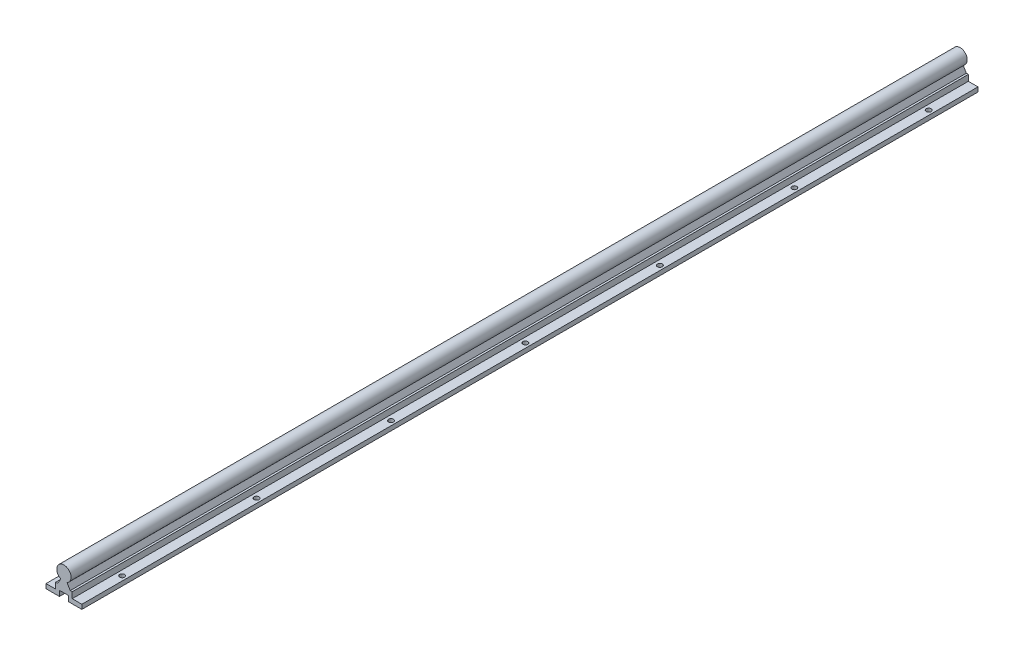
ISO-10303-21;
HEADER;
FILE_DESCRIPTION(('STEP AP214'),'2;1');
FILE_NAME('part.step','',(''),(''),'','','');
FILE_SCHEMA(('AUTOMOTIVE_DESIGN { 1 0 10303 214 1 1 1 1 }'));
ENDSEC;
DATA;
#1=APPLICATION_CONTEXT('core data for automotive mechanical design processes');
#2=APPLICATION_PROTOCOL_DEFINITION('international standard','automotive_design',2000,#1);
#3=PRODUCT_CONTEXT('',#1,'mechanical');
#4=PRODUCT('Part','Part','',(#3));
#5=PRODUCT_RELATED_PRODUCT_CATEGORY('part','',(#4));
#6=PRODUCT_DEFINITION_FORMATION('','',#4);
#7=PRODUCT_DEFINITION_CONTEXT('part definition',#1,'design');
#8=PRODUCT_DEFINITION('design','',#6,#7);
#9=PRODUCT_DEFINITION_SHAPE('','',#8);
#10=(LENGTH_UNIT() NAMED_UNIT(*) SI_UNIT(.MILLI.,.METRE.));
#11=(NAMED_UNIT(*) PLANE_ANGLE_UNIT() SI_UNIT($,.RADIAN.));
#12=(NAMED_UNIT(*) SI_UNIT($,.STERADIAN.) SOLID_ANGLE_UNIT());
#13=UNCERTAINTY_MEASURE_WITH_UNIT(LENGTH_MEASURE(1.E-05),#10,'distance_accuracy_value','');
#14=(GEOMETRIC_REPRESENTATION_CONTEXT(3) GLOBAL_UNCERTAINTY_ASSIGNED_CONTEXT((#13)) GLOBAL_UNIT_ASSIGNED_CONTEXT((#10,
#11,#12)) REPRESENTATION_CONTEXT('',''));
#15=CARTESIAN_POINT('',(0.,0.,0.));
#16=DIRECTION('',(0.,0.,1.));
#17=DIRECTION('',(1.,0.,0.));
#18=AXIS2_PLACEMENT_3D('',#15,#16,#17);
#19=CARTESIAN_POINT('',(0.,0.,500.));
#20=DIRECTION('',(0.,0.,-1.));
#21=DIRECTION('',(-1.,0.,0.));
#22=AXIS2_PLACEMENT_3D('',#19,#20,#21);
#23=CYLINDRICAL_SURFACE('',#22,8.);
#24=CARTESIAN_POINT('',(0.,0.,-500.));
#25=DIRECTION('',(0.,0.,1.));
#26=DIRECTION('',(1.,0.,0.));
#27=AXIS2_PLACEMENT_3D('',#24,#25,#26);
#28=CIRCLE('',#27,8.);
#29=CARTESIAN_POINT('',(3.48711915483254,-7.2,-500.));
#30=VERTEX_POINT('',#29);
#31=CARTESIAN_POINT('',(-3.48711915483254,-7.2,-500.));
#32=VERTEX_POINT('',#31);
#33=EDGE_CURVE('E180',#30,#32,#28,.T.);
#34=ORIENTED_EDGE('',*,*,#33,.T.);
#35=DIRECTION('',(0.,0.,-1.));
#36=VECTOR('',#35,1.);
#37=CARTESIAN_POINT('',(-3.48711915483254,-7.2,500.));
#38=LINE('',#37,#36);
#39=CARTESIAN_POINT('',(-3.48711915483254,-7.2,500.));
#40=VERTEX_POINT('',#39);
#41=EDGE_CURVE('E11',#40,#32,#38,.T.);
#42=ORIENTED_EDGE('',*,*,#41,.F.);
#43=CARTESIAN_POINT('',(0.,0.,500.));
#44=DIRECTION('',(0.,0.,1.));
#45=DIRECTION('',(1.,0.,0.));
#46=AXIS2_PLACEMENT_3D('',#43,#44,#45);
#47=CIRCLE('',#46,8.);
#48=CARTESIAN_POINT('',(3.48711915483254,-7.2,500.));
#49=VERTEX_POINT('',#48);
#50=EDGE_CURVE('E211',#49,#40,#47,.T.);
#51=ORIENTED_EDGE('',*,*,#50,.F.);
#52=DIRECTION('',(0.,0.,-1.));
#53=VECTOR('',#52,1.);
#54=CARTESIAN_POINT('',(3.48711915483254,-7.2,500.));
#55=LINE('',#54,#53);
#56=EDGE_CURVE('E176',#49,#30,#55,.T.);
#57=ORIENTED_EDGE('',*,*,#56,.T.);
#58=EDGE_LOOP('',(#34,#42,#51,#57));
#59=FACE_BOUND('',#58,.T.);
#60=ADVANCED_FACE('F36',(#59),#23,.T.);
#61=CARTESIAN_POINT('',(-7.00895579688922,-13.3,500.));
#62=DIRECTION('',(0.866025403784441,-0.499999999999997,0.));
#63=DIRECTION('',(0.499999999999997,0.866025403784441,0.));
#64=AXIS2_PLACEMENT_3D('',#61,#62,#63);
#65=PLANE('',#64);
#66=DIRECTION('',(-0.499999999999997,-0.866025403784441,0.));
#67=VECTOR('',#66,1.);
#68=CARTESIAN_POINT('',(-7.00895579688922,-13.3,-500.));
#69=LINE('',#68,#67);
#70=CARTESIAN_POINT('',(-7.00895579688922,-13.3,-500.));
#71=VERTEX_POINT('',#70);
#72=EDGE_CURVE('E183',#32,#71,#69,.T.);
#73=ORIENTED_EDGE('',*,*,#72,.T.);
#74=DIRECTION('',(0.,0.,-1.));
#75=VECTOR('',#74,1.);
#76=CARTESIAN_POINT('',(-7.00895579688922,-13.3,500.));
#77=LINE('',#76,#75);
#78=CARTESIAN_POINT('',(-7.00895579688922,-13.3,500.));
#79=VERTEX_POINT('',#78);
#80=EDGE_CURVE('E44',#79,#71,#77,.T.);
#81=ORIENTED_EDGE('',*,*,#80,.F.);
#82=DIRECTION('',(-0.499999999999997,-0.866025403784441,0.));
#83=VECTOR('',#82,1.);
#84=CARTESIAN_POINT('',(-7.00895579688922,-13.3,500.));
#85=LINE('',#84,#83);
#86=EDGE_CURVE('E119',#40,#79,#85,.T.);
#87=ORIENTED_EDGE('',*,*,#86,.F.);
#88=ORIENTED_EDGE('',*,*,#41,.T.);
#89=EDGE_LOOP('',(#73,#81,#87,#88));
#90=FACE_BOUND('',#89,.T.);
#91=ADVANCED_FACE('F309',(#90),#65,.F.);
#92=CARTESIAN_POINT('',(-9.25,-13.3,500.));
#93=DIRECTION('',(0.,-1.,0.));
#94=DIRECTION('',(0.,0.,-1.));
#95=AXIS2_PLACEMENT_3D('',#92,#93,#94);
#96=PLANE('',#95);
#97=DIRECTION('',(-1.,0.,0.));
#98=VECTOR('',#97,1.);
#99=CARTESIAN_POINT('',(-9.25,-13.3,-500.));
#100=LINE('',#99,#98);
#101=CARTESIAN_POINT('',(-9.25,-13.3,-500.));
#102=VERTEX_POINT('',#101);
#103=EDGE_CURVE('E186',#71,#102,#100,.T.);
#104=ORIENTED_EDGE('',*,*,#103,.T.);
#105=DIRECTION('',(0.,0.,-1.));
#106=VECTOR('',#105,1.);
#107=CARTESIAN_POINT('',(-9.25,-13.3,500.));
#108=LINE('',#107,#106);
#109=CARTESIAN_POINT('',(-9.25,-13.3,500.));
#110=VERTEX_POINT('',#109);
#111=EDGE_CURVE('E242',#110,#102,#108,.T.);
#112=ORIENTED_EDGE('',*,*,#111,.F.);
#113=DIRECTION('',(-1.,0.,0.));
#114=VECTOR('',#113,1.);
#115=CARTESIAN_POINT('',(-9.25,-13.3,500.));
#116=LINE('',#115,#114);
#117=EDGE_CURVE('E250',#79,#110,#116,.T.);
#118=ORIENTED_EDGE('',*,*,#117,.F.);
#119=ORIENTED_EDGE('',*,*,#80,.T.);
#120=EDGE_LOOP('',(#104,#112,#118,#119));
#121=FACE_BOUND('',#120,.T.);
#122=ADVANCED_FACE('F248',(#121),#96,.F.);
#123=CARTESIAN_POINT('',(-9.25,-20.,500.));
#124=DIRECTION('',(1.,0.,0.));
#125=DIRECTION('',(0.,0.,-1.));
#126=AXIS2_PLACEMENT_3D('',#123,#124,#125);
#127=PLANE('',#126);
#128=DIRECTION('',(0.,-1.,0.));
#129=VECTOR('',#128,1.);
#130=CARTESIAN_POINT('',(-9.25,-20.,-500.));
#131=LINE('',#130,#129);
#132=CARTESIAN_POINT('',(-9.25,-20.,-500.));
#133=VERTEX_POINT('',#132);
#134=EDGE_CURVE('E188',#102,#133,#131,.T.);
#135=ORIENTED_EDGE('',*,*,#134,.T.);
#136=DIRECTION('',(0.,0.,-1.));
#137=VECTOR('',#136,1.);
#138=CARTESIAN_POINT('',(-9.25,-20.,500.));
#139=LINE('',#138,#137);
#140=CARTESIAN_POINT('',(-9.25,-20.,500.));
#141=VERTEX_POINT('',#140);
#142=EDGE_CURVE('E239',#141,#133,#139,.T.);
#143=ORIENTED_EDGE('',*,*,#142,.F.);
#144=DIRECTION('',(0.,-1.,0.));
#145=VECTOR('',#144,1.);
#146=CARTESIAN_POINT('',(-9.25,-20.,500.));
#147=LINE('',#146,#145);
#148=EDGE_CURVE('E268',#110,#141,#147,.T.);
#149=ORIENTED_EDGE('',*,*,#148,.F.);
#150=ORIENTED_EDGE('',*,*,#111,.T.);
#151=EDGE_LOOP('',(#135,#143,#149,#150));
#152=FACE_BOUND('',#151,.T.);
#153=ADVANCED_FACE('F259',(#152),#127,.F.);
#154=CARTESIAN_POINT('',(-20.,-20.,500.));
#155=DIRECTION('',(0.,-1.,0.));
#156=DIRECTION('',(0.,0.,-1.));
#157=AXIS2_PLACEMENT_3D('',#154,#155,#156);
#158=PLANE('',#157);
#159=CARTESIAN_POINT('',(-14.9999999999999,-20.,0.));
#160=DIRECTION('',(0.,1.,0.));
#161=DIRECTION('',(0.,0.,1.));
#162=AXIS2_PLACEMENT_3D('',#159,#160,#161);
#163=CIRCLE('',#162,2.75);
#164=CARTESIAN_POINT('',(-14.9999999999999,-20.,2.75000000000005));
#165=VERTEX_POINT('',#164);
#166=EDGE_CURVE('E555',#165,#165,#163,.T.);
#167=ORIENTED_EDGE('',*,*,#166,.F.);
#168=EDGE_LOOP('',(#167));
#169=FACE_BOUND('',#168,.T.);
#170=CARTESIAN_POINT('',(-14.9999999999999,-20.,-150.));
#171=DIRECTION('',(0.,1.,0.));
#172=DIRECTION('',(0.,0.,1.));
#173=AXIS2_PLACEMENT_3D('',#170,#171,#172);
#174=CIRCLE('',#173,2.75);
#175=CARTESIAN_POINT('',(-14.9999999999999,-20.,-147.25));
#176=VERTEX_POINT('',#175);
#177=EDGE_CURVE('E663',#176,#176,#174,.T.);
#178=ORIENTED_EDGE('',*,*,#177,.F.);
#179=EDGE_LOOP('',(#178));
#180=FACE_BOUND('',#179,.T.);
#181=CARTESIAN_POINT('',(-14.9999999999999,-20.,300.));
#182=DIRECTION('',(0.,1.,0.));
#183=DIRECTION('',(0.,0.,1.));
#184=AXIS2_PLACEMENT_3D('',#181,#182,#183);
#185=CIRCLE('',#184,2.75);
#186=CARTESIAN_POINT('',(-14.9999999999999,-20.,302.75));
#187=VERTEX_POINT('',#186);
#188=EDGE_CURVE('E584',#187,#187,#185,.T.);
#189=ORIENTED_EDGE('',*,*,#188,.F.);
#190=EDGE_LOOP('',(#189));
#191=FACE_BOUND('',#190,.T.);
#192=CARTESIAN_POINT('',(-14.9999999999999,-20.,150.));
#193=DIRECTION('',(0.,1.,0.));
#194=DIRECTION('',(0.,0.,1.));
#195=AXIS2_PLACEMENT_3D('',#192,#193,#194);
#196=CIRCLE('',#195,2.75);
#197=CARTESIAN_POINT('',(-14.9999999999999,-20.,152.75));
#198=VERTEX_POINT('',#197);
#199=EDGE_CURVE('E572',#198,#198,#196,.T.);
#200=ORIENTED_EDGE('',*,*,#199,.F.);
#201=EDGE_LOOP('',(#200));
#202=FACE_BOUND('',#201,.T.);
#203=CARTESIAN_POINT('',(-14.9999999999999,-20.,-450.));
#204=DIRECTION('',(0.,1.,0.));
#205=DIRECTION('',(0.,0.,1.));
#206=AXIS2_PLACEMENT_3D('',#203,#204,#205);
#207=CIRCLE('',#206,2.75);
#208=CARTESIAN_POINT('',(-14.9999999999999,-20.,-447.25));
#209=VERTEX_POINT('',#208);
#210=EDGE_CURVE('E657',#209,#209,#207,.T.);
#211=ORIENTED_EDGE('',*,*,#210,.F.);
#212=EDGE_LOOP('',(#211));
#213=FACE_BOUND('',#212,.T.);
#214=CARTESIAN_POINT('',(-14.9999999999999,-20.,-300.));
#215=DIRECTION('',(0.,1.,0.));
#216=DIRECTION('',(0.,0.,1.));
#217=AXIS2_PLACEMENT_3D('',#214,#215,#216);
#218=CIRCLE('',#217,2.75);
#219=CARTESIAN_POINT('',(-14.9999999999999,-20.,-297.25));
#220=VERTEX_POINT('',#219);
#221=EDGE_CURVE('E654',#220,#220,#218,.T.);
#222=ORIENTED_EDGE('',*,*,#221,.F.);
#223=EDGE_LOOP('',(#222));
#224=FACE_BOUND('',#223,.T.);
#225=CARTESIAN_POINT('',(-14.9999999999999,-20.,450.));
#226=DIRECTION('',(0.,1.,0.));
#227=DIRECTION('',(0.,0.,1.));
#228=AXIS2_PLACEMENT_3D('',#225,#226,#227);
#229=CIRCLE('',#228,2.75);
#230=CARTESIAN_POINT('',(-14.9999999999999,-20.,452.75));
#231=VERTEX_POINT('',#230);
#232=EDGE_CURVE('E595',#231,#231,#229,.T.);
#233=ORIENTED_EDGE('',*,*,#232,.F.);
#234=EDGE_LOOP('',(#233));
#235=FACE_BOUND('',#234,.T.);
#236=DIRECTION('',(-1.,0.,0.));
#237=VECTOR('',#236,1.);
#238=CARTESIAN_POINT('',(-20.,-20.,-500.));
#239=LINE('',#238,#237);
#240=CARTESIAN_POINT('',(-20.,-20.,-500.));
#241=VERTEX_POINT('',#240);
#242=EDGE_CURVE('E190',#133,#241,#239,.T.);
#243=ORIENTED_EDGE('',*,*,#242,.T.);
#244=DIRECTION('',(0.,0.,-1.));
#245=VECTOR('',#244,1.);
#246=CARTESIAN_POINT('',(-20.,-20.,500.));
#247=LINE('',#246,#245);
#248=CARTESIAN_POINT('',(-20.,-20.,500.));
#249=VERTEX_POINT('',#248);
#250=EDGE_CURVE('E236',#249,#241,#247,.T.);
#251=ORIENTED_EDGE('',*,*,#250,.F.);
#252=DIRECTION('',(-1.,0.,0.));
#253=VECTOR('',#252,1.);
#254=CARTESIAN_POINT('',(-20.,-20.,500.));
#255=LINE('',#254,#253);
#256=EDGE_CURVE('E265',#141,#249,#255,.T.);
#257=ORIENTED_EDGE('',*,*,#256,.F.);
#258=ORIENTED_EDGE('',*,*,#142,.T.);
#259=EDGE_LOOP('',(#243,#251,#257,#258));
#260=FACE_BOUND('',#259,.T.);
#261=ADVANCED_FACE('F263',(#169,#180,#191,#202,#213,#224,#235,#260),#158,.F.);
#262=CARTESIAN_POINT('',(-20.,-25.,500.));
#263=DIRECTION('',(1.,0.,0.));
#264=DIRECTION('',(0.,0.,-1.));
#265=AXIS2_PLACEMENT_3D('',#262,#263,#264);
#266=PLANE('',#265);
#267=DIRECTION('',(0.,-1.,0.));
#268=VECTOR('',#267,1.);
#269=CARTESIAN_POINT('',(-20.,-25.,-500.));
#270=LINE('',#269,#268);
#271=CARTESIAN_POINT('',(-20.,-25.,-500.));
#272=VERTEX_POINT('',#271);
#273=EDGE_CURVE('E192',#241,#272,#270,.T.);
#274=ORIENTED_EDGE('',*,*,#273,.T.);
#275=DIRECTION('',(0.,0.,-1.));
#276=VECTOR('',#275,1.);
#277=CARTESIAN_POINT('',(-20.,-25.,500.));
#278=LINE('',#277,#276);
#279=CARTESIAN_POINT('',(-20.,-25.,500.));
#280=VERTEX_POINT('',#279);
#281=EDGE_CURVE('E233',#280,#272,#278,.T.);
#282=ORIENTED_EDGE('',*,*,#281,.F.);
#283=DIRECTION('',(0.,-1.,0.));
#284=VECTOR('',#283,1.);
#285=CARTESIAN_POINT('',(-20.,-25.,500.));
#286=LINE('',#285,#284);
#287=EDGE_CURVE('E267',#249,#280,#286,.T.);
#288=ORIENTED_EDGE('',*,*,#287,.F.);
#289=ORIENTED_EDGE('',*,*,#250,.T.);
#290=EDGE_LOOP('',(#274,#282,#288,#289));
#291=FACE_BOUND('',#290,.T.);
#292=ADVANCED_FACE('F322',(#291),#266,.F.);
#293=CARTESIAN_POINT('',(-5.,-25.,500.));
#294=DIRECTION('',(0.,1.,0.));
#295=DIRECTION('',(-1.,0.,0.));
#296=AXIS2_PLACEMENT_3D('',#293,#294,#295);
#297=PLANE('',#296);
#298=CARTESIAN_POINT('',(-14.9999999999999,-25.,0.));
#299=DIRECTION('',(0.,1.,0.));
#300=DIRECTION('',(0.,0.,1.));
#301=AXIS2_PLACEMENT_3D('',#298,#299,#300);
#302=CIRCLE('',#301,2.75);
#303=CARTESIAN_POINT('',(-14.9999999999999,-25.,2.75000000000005));
#304=VERTEX_POINT('',#303);
#305=EDGE_CURVE('E552',#304,#304,#302,.T.);
#306=ORIENTED_EDGE('',*,*,#305,.T.);
#307=EDGE_LOOP('',(#306));
#308=FACE_BOUND('',#307,.T.);
#309=CARTESIAN_POINT('',(-14.9999999999999,-25.,-150.));
#310=DIRECTION('',(0.,1.,0.));
#311=DIRECTION('',(0.,0.,1.));
#312=AXIS2_PLACEMENT_3D('',#309,#310,#311);
#313=CIRCLE('',#312,2.75);
#314=CARTESIAN_POINT('',(-14.9999999999999,-25.,-147.25));
#315=VERTEX_POINT('',#314);
#316=EDGE_CURVE('E567',#315,#315,#313,.T.);
#317=ORIENTED_EDGE('',*,*,#316,.T.);
#318=EDGE_LOOP('',(#317));
#319=FACE_BOUND('',#318,.T.);
#320=CARTESIAN_POINT('',(-14.9999999999999,-25.,300.));
#321=DIRECTION('',(0.,1.,0.));
#322=DIRECTION('',(0.,0.,1.));
#323=AXIS2_PLACEMENT_3D('',#320,#321,#322);
#324=CIRCLE('',#323,2.75);
#325=CARTESIAN_POINT('',(-14.9999999999999,-25.,302.75));
#326=VERTEX_POINT('',#325);
#327=EDGE_CURVE('E580',#326,#326,#324,.T.);
#328=ORIENTED_EDGE('',*,*,#327,.T.);
#329=EDGE_LOOP('',(#328));
#330=FACE_BOUND('',#329,.T.);
#331=CARTESIAN_POINT('',(-14.9999999999999,-25.,150.));
#332=DIRECTION('',(0.,1.,0.));
#333=DIRECTION('',(0.,0.,1.));
#334=AXIS2_PLACEMENT_3D('',#331,#332,#333);
#335=CIRCLE('',#334,2.75);
#336=CARTESIAN_POINT('',(-14.9999999999999,-25.,152.75));
#337=VERTEX_POINT('',#336);
#338=EDGE_CURVE('E568',#337,#337,#335,.T.);
#339=ORIENTED_EDGE('',*,*,#338,.T.);
#340=EDGE_LOOP('',(#339));
#341=FACE_BOUND('',#340,.T.);
#342=CARTESIAN_POINT('',(-14.9999999999999,-25.,-450.));
#343=DIRECTION('',(0.,1.,0.));
#344=DIRECTION('',(0.,0.,1.));
#345=AXIS2_PLACEMENT_3D('',#342,#343,#344);
#346=CIRCLE('',#345,2.75);
#347=CARTESIAN_POINT('',(-14.9999999999999,-25.,-447.25));
#348=VERTEX_POINT('',#347);
#349=EDGE_CURVE('E651',#348,#348,#346,.T.);
#350=ORIENTED_EDGE('',*,*,#349,.T.);
#351=EDGE_LOOP('',(#350));
#352=FACE_BOUND('',#351,.T.);
#353=CARTESIAN_POINT('',(-14.9999999999999,-25.,-300.));
#354=DIRECTION('',(0.,1.,0.));
#355=DIRECTION('',(0.,0.,1.));
#356=AXIS2_PLACEMENT_3D('',#353,#354,#355);
#357=CIRCLE('',#356,2.75);
#358=CARTESIAN_POINT('',(-14.9999999999999,-25.,-297.25));
#359=VERTEX_POINT('',#358);
#360=EDGE_CURVE('E670',#359,#359,#357,.T.);
#361=ORIENTED_EDGE('',*,*,#360,.T.);
#362=EDGE_LOOP('',(#361));
#363=FACE_BOUND('',#362,.T.);
#364=CARTESIAN_POINT('',(-14.9999999999999,-25.,450.));
#365=DIRECTION('',(0.,1.,0.));
#366=DIRECTION('',(0.,0.,1.));
#367=AXIS2_PLACEMENT_3D('',#364,#365,#366);
#368=CIRCLE('',#367,2.75);
#369=CARTESIAN_POINT('',(-14.9999999999999,-25.,452.75));
#370=VERTEX_POINT('',#369);
#371=EDGE_CURVE('E603',#370,#370,#368,.T.);
#372=ORIENTED_EDGE('',*,*,#371,.T.);
#373=EDGE_LOOP('',(#372));
#374=FACE_BOUND('',#373,.T.);
#375=DIRECTION('',(1.,0.,0.));
#376=VECTOR('',#375,1.);
#377=CARTESIAN_POINT('',(-5.,-25.,-500.));
#378=LINE('',#377,#376);
#379=CARTESIAN_POINT('',(-5.,-25.,-500.));
#380=VERTEX_POINT('',#379);
#381=EDGE_CURVE('E194',#272,#380,#378,.T.);
#382=ORIENTED_EDGE('',*,*,#381,.T.);
#383=DIRECTION('',(0.,0.,-1.));
#384=VECTOR('',#383,1.);
#385=CARTESIAN_POINT('',(-5.,-25.,500.));
#386=LINE('',#385,#384);
#387=CARTESIAN_POINT('',(-5.,-25.,500.));
#388=VERTEX_POINT('',#387);
#389=EDGE_CURVE('E230',#388,#380,#386,.T.);
#390=ORIENTED_EDGE('',*,*,#389,.F.);
#391=DIRECTION('',(1.,0.,0.));
#392=VECTOR('',#391,1.);
#393=CARTESIAN_POINT('',(-5.,-25.,500.));
#394=LINE('',#393,#392);
#395=EDGE_CURVE('E270',#280,#388,#394,.T.);
#396=ORIENTED_EDGE('',*,*,#395,.F.);
#397=ORIENTED_EDGE('',*,*,#281,.T.);
#398=EDGE_LOOP('',(#382,#390,#396,#397));
#399=FACE_BOUND('',#398,.T.);
#400=ADVANCED_FACE('F326',(#308,#319,#330,#341,#352,#363,#374,#399),#297,.F.);
#401=CARTESIAN_POINT('',(-5.,-19.,500.));
#402=DIRECTION('',(-1.,0.,0.));
#403=DIRECTION('',(0.,-1.,0.));
#404=AXIS2_PLACEMENT_3D('',#401,#402,#403);
#405=PLANE('',#404);
#406=DIRECTION('',(0.,1.,0.));
#407=VECTOR('',#406,1.);
#408=CARTESIAN_POINT('',(-5.,-19.,-500.));
#409=LINE('',#408,#407);
#410=CARTESIAN_POINT('',(-5.,-19.,-500.));
#411=VERTEX_POINT('',#410);
#412=EDGE_CURVE('E196',#380,#411,#409,.T.);
#413=ORIENTED_EDGE('',*,*,#412,.T.);
#414=DIRECTION('',(0.,0.,-1.));
#415=VECTOR('',#414,1.);
#416=CARTESIAN_POINT('',(-5.,-19.,500.));
#417=LINE('',#416,#415);
#418=CARTESIAN_POINT('',(-5.,-19.,500.));
#419=VERTEX_POINT('',#418);
#420=EDGE_CURVE('E227',#419,#411,#417,.T.);
#421=ORIENTED_EDGE('',*,*,#420,.F.);
#422=DIRECTION('',(0.,1.,0.));
#423=VECTOR('',#422,1.);
#424=CARTESIAN_POINT('',(-5.,-19.,500.));
#425=LINE('',#424,#423);
#426=EDGE_CURVE('E276',#388,#419,#425,.T.);
#427=ORIENTED_EDGE('',*,*,#426,.F.);
#428=ORIENTED_EDGE('',*,*,#389,.T.);
#429=EDGE_LOOP('',(#413,#421,#427,#428));
#430=FACE_BOUND('',#429,.T.);
#431=ADVANCED_FACE('F330',(#430),#405,.F.);
#432=CARTESIAN_POINT('',(5.,-19.,500.));
#433=DIRECTION('',(0.,1.,0.));
#434=DIRECTION('',(0.,0.,1.));
#435=AXIS2_PLACEMENT_3D('',#432,#433,#434);
#436=PLANE('',#435);
#437=DIRECTION('',(1.,0.,0.));
#438=VECTOR('',#437,1.);
#439=CARTESIAN_POINT('',(5.,-19.,-500.));
#440=LINE('',#439,#438);
#441=CARTESIAN_POINT('',(5.,-19.,-500.));
#442=VERTEX_POINT('',#441);
#443=EDGE_CURVE('E198',#411,#442,#440,.T.);
#444=ORIENTED_EDGE('',*,*,#443,.T.);
#445=DIRECTION('',(0.,0.,-1.));
#446=VECTOR('',#445,1.);
#447=CARTESIAN_POINT('',(5.,-19.,500.));
#448=LINE('',#447,#446);
#449=CARTESIAN_POINT('',(5.,-19.,500.));
#450=VERTEX_POINT('',#449);
#451=EDGE_CURVE('E224',#450,#442,#448,.T.);
#452=ORIENTED_EDGE('',*,*,#451,.F.);
#453=DIRECTION('',(1.,0.,0.));
#454=VECTOR('',#453,1.);
#455=CARTESIAN_POINT('',(5.,-19.,500.));
#456=LINE('',#455,#454);
#457=EDGE_CURVE('E278',#419,#450,#456,.T.);
#458=ORIENTED_EDGE('',*,*,#457,.F.);
#459=ORIENTED_EDGE('',*,*,#420,.T.);
#460=EDGE_LOOP('',(#444,#452,#458,#459));
#461=FACE_BOUND('',#460,.T.);
#462=ADVANCED_FACE('F334',(#461),#436,.F.);
#463=CARTESIAN_POINT('',(5.,-25.,500.));
#464=DIRECTION('',(1.,0.,0.));
#465=DIRECTION('',(0.,1.,0.));
#466=AXIS2_PLACEMENT_3D('',#463,#464,#465);
#467=PLANE('',#466);
#468=DIRECTION('',(0.,-1.,0.));
#469=VECTOR('',#468,1.);
#470=CARTESIAN_POINT('',(5.,-25.,-500.));
#471=LINE('',#470,#469);
#472=CARTESIAN_POINT('',(5.,-25.,-500.));
#473=VERTEX_POINT('',#472);
#474=EDGE_CURVE('E200',#442,#473,#471,.T.);
#475=ORIENTED_EDGE('',*,*,#474,.T.);
#476=DIRECTION('',(0.,0.,-1.));
#477=VECTOR('',#476,1.);
#478=CARTESIAN_POINT('',(5.,-25.,500.));
#479=LINE('',#478,#477);
#480=CARTESIAN_POINT('',(5.,-25.,500.));
#481=VERTEX_POINT('',#480);
#482=EDGE_CURVE('E221',#481,#473,#479,.T.);
#483=ORIENTED_EDGE('',*,*,#482,.F.);
#484=DIRECTION('',(0.,-1.,0.));
#485=VECTOR('',#484,1.);
#486=CARTESIAN_POINT('',(5.,-25.,500.));
#487=LINE('',#486,#485);
#488=EDGE_CURVE('E280',#450,#481,#487,.T.);
#489=ORIENTED_EDGE('',*,*,#488,.F.);
#490=ORIENTED_EDGE('',*,*,#451,.T.);
#491=EDGE_LOOP('',(#475,#483,#489,#490));
#492=FACE_BOUND('',#491,.T.);
#493=ADVANCED_FACE('F338',(#492),#467,.F.);
#494=CARTESIAN_POINT('',(20.,-25.,500.));
#495=DIRECTION('',(0.,1.,0.));
#496=DIRECTION('',(0.,0.,1.));
#497=AXIS2_PLACEMENT_3D('',#494,#495,#496);
#498=PLANE('',#497);
#499=CARTESIAN_POINT('',(15.0000000000001,-25.,-150.));
#500=DIRECTION('',(0.,1.,0.));
#501=DIRECTION('',(0.,0.,1.));
#502=AXIS2_PLACEMENT_3D('',#499,#500,#501);
#503=CIRCLE('',#502,2.75);
#504=CARTESIAN_POINT('',(15.0000000000001,-25.,-147.25));
#505=VERTEX_POINT('',#504);
#506=EDGE_CURVE('E556',#505,#505,#503,.T.);
#507=ORIENTED_EDGE('',*,*,#506,.T.);
#508=EDGE_LOOP('',(#507));
#509=FACE_BOUND('',#508,.T.);
#510=CARTESIAN_POINT('',(15.0000000000001,-25.,-300.));
#511=DIRECTION('',(0.,1.,0.));
#512=DIRECTION('',(0.,0.,1.));
#513=AXIS2_PLACEMENT_3D('',#510,#511,#512);
#514=CIRCLE('',#513,2.75);
#515=CARTESIAN_POINT('',(15.0000000000001,-25.,-297.25));
#516=VERTEX_POINT('',#515);
#517=EDGE_CURVE('E666',#516,#516,#514,.T.);
#518=ORIENTED_EDGE('',*,*,#517,.T.);
#519=EDGE_LOOP('',(#518));
#520=FACE_BOUND('',#519,.T.);
#521=CARTESIAN_POINT('',(15.0000000000001,-25.,150.));
#522=DIRECTION('',(0.,1.,0.));
#523=DIRECTION('',(0.,0.,1.));
#524=AXIS2_PLACEMENT_3D('',#521,#522,#523);
#525=CIRCLE('',#524,2.75);
#526=CARTESIAN_POINT('',(15.0000000000001,-25.,152.75));
#527=VERTEX_POINT('',#526);
#528=EDGE_CURVE('E587',#527,#527,#525,.T.);
#529=ORIENTED_EDGE('',*,*,#528,.T.);
#530=EDGE_LOOP('',(#529));
#531=FACE_BOUND('',#530,.T.);
#532=CARTESIAN_POINT('',(15.0000000000001,-25.,0.));
#533=DIRECTION('',(0.,1.,0.));
#534=DIRECTION('',(0.,0.,1.));
#535=AXIS2_PLACEMENT_3D('',#532,#533,#534);
#536=CIRCLE('',#535,2.75);
#537=CARTESIAN_POINT('',(15.0000000000001,-25.,2.75000000000005));
#538=VERTEX_POINT('',#537);
#539=EDGE_CURVE('E575',#538,#538,#536,.T.);
#540=ORIENTED_EDGE('',*,*,#539,.T.);
#541=EDGE_LOOP('',(#540));
#542=FACE_BOUND('',#541,.T.);
#543=CARTESIAN_POINT('',(15.0000000000001,-25.,-450.));
#544=DIRECTION('',(0.,1.,0.));
#545=DIRECTION('',(0.,0.,1.));
#546=AXIS2_PLACEMENT_3D('',#543,#544,#545);
#547=CIRCLE('',#546,2.75);
#548=CARTESIAN_POINT('',(15.0000000000001,-25.,-447.25));
#549=VERTEX_POINT('',#548);
#550=EDGE_CURVE('E650',#549,#549,#547,.T.);
#551=ORIENTED_EDGE('',*,*,#550,.T.);
#552=EDGE_LOOP('',(#551));
#553=FACE_BOUND('',#552,.T.);
#554=CARTESIAN_POINT('',(15.0000000000001,-25.,300.));
#555=DIRECTION('',(0.,1.,0.));
#556=DIRECTION('',(0.,0.,1.));
#557=AXIS2_PLACEMENT_3D('',#554,#555,#556);
#558=CIRCLE('',#557,2.75);
#559=CARTESIAN_POINT('',(15.0000000000001,-25.,302.75));
#560=VERTEX_POINT('',#559);
#561=EDGE_CURVE('E592',#560,#560,#558,.T.);
#562=ORIENTED_EDGE('',*,*,#561,.T.);
#563=EDGE_LOOP('',(#562));
#564=FACE_BOUND('',#563,.T.);
#565=CARTESIAN_POINT('',(15.0000000000001,-25.,450.));
#566=DIRECTION('',(0.,1.,0.));
#567=DIRECTION('',(0.,0.,1.));
#568=AXIS2_PLACEMENT_3D('',#565,#566,#567);
#569=CIRCLE('',#568,2.75);
#570=CARTESIAN_POINT('',(15.0000000000001,-25.,452.75));
#571=VERTEX_POINT('',#570);
#572=EDGE_CURVE('E184',#571,#571,#569,.T.);
#573=ORIENTED_EDGE('',*,*,#572,.T.);
#574=EDGE_LOOP('',(#573));
#575=FACE_BOUND('',#574,.T.);
#576=DIRECTION('',(1.,0.,0.));
#577=VECTOR('',#576,1.);
#578=CARTESIAN_POINT('',(20.,-25.,-500.));
#579=LINE('',#578,#577);
#580=CARTESIAN_POINT('',(20.,-25.,-500.));
#581=VERTEX_POINT('',#580);
#582=EDGE_CURVE('E202',#473,#581,#579,.T.);
#583=ORIENTED_EDGE('',*,*,#582,.T.);
#584=DIRECTION('',(0.,0.,-1.));
#585=VECTOR('',#584,1.);
#586=CARTESIAN_POINT('',(20.,-25.,500.));
#587=LINE('',#586,#585);
#588=CARTESIAN_POINT('',(20.,-25.,500.));
#589=VERTEX_POINT('',#588);
#590=EDGE_CURVE('E218',#589,#581,#587,.T.);
#591=ORIENTED_EDGE('',*,*,#590,.F.);
#592=DIRECTION('',(1.,0.,0.));
#593=VECTOR('',#592,1.);
#594=CARTESIAN_POINT('',(20.,-25.,500.));
#595=LINE('',#594,#593);
#596=EDGE_CURVE('E282',#481,#589,#595,.T.);
#597=ORIENTED_EDGE('',*,*,#596,.F.);
#598=ORIENTED_EDGE('',*,*,#482,.T.);
#599=EDGE_LOOP('',(#583,#591,#597,#598));
#600=FACE_BOUND('',#599,.T.);
#601=ADVANCED_FACE('F342',(#509,#520,#531,#542,#553,#564,#575,#600),#498,.F.);
#602=CARTESIAN_POINT('',(20.,-20.,500.));
#603=DIRECTION('',(-1.,0.,0.));
#604=DIRECTION('',(0.,0.,1.));
#605=AXIS2_PLACEMENT_3D('',#602,#603,#604);
#606=PLANE('',#605);
#607=DIRECTION('',(0.,1.,0.));
#608=VECTOR('',#607,1.);
#609=CARTESIAN_POINT('',(20.,-20.,-500.));
#610=LINE('',#609,#608);
#611=CARTESIAN_POINT('',(20.,-20.,-500.));
#612=VERTEX_POINT('',#611);
#613=EDGE_CURVE('E204',#581,#612,#610,.T.);
#614=ORIENTED_EDGE('',*,*,#613,.T.);
#615=DIRECTION('',(0.,0.,-1.));
#616=VECTOR('',#615,1.);
#617=CARTESIAN_POINT('',(20.,-20.,500.));
#618=LINE('',#617,#616);
#619=CARTESIAN_POINT('',(20.,-20.,500.));
#620=VERTEX_POINT('',#619);
#621=EDGE_CURVE('E215',#620,#612,#618,.T.);
#622=ORIENTED_EDGE('',*,*,#621,.F.);
#623=DIRECTION('',(0.,1.,0.));
#624=VECTOR('',#623,1.);
#625=CARTESIAN_POINT('',(20.,-20.,500.));
#626=LINE('',#625,#624);
#627=EDGE_CURVE('E284',#589,#620,#626,.T.);
#628=ORIENTED_EDGE('',*,*,#627,.F.);
#629=ORIENTED_EDGE('',*,*,#590,.T.);
#630=EDGE_LOOP('',(#614,#622,#628,#629));
#631=FACE_BOUND('',#630,.T.);
#632=ADVANCED_FACE('F290',(#631),#606,.F.);
#633=CARTESIAN_POINT('',(9.25,-20.,500.));
#634=DIRECTION('',(0.,-1.,0.));
#635=DIRECTION('',(0.,0.,-1.));
#636=AXIS2_PLACEMENT_3D('',#633,#634,#635);
#637=PLANE('',#636);
#638=CARTESIAN_POINT('',(15.0000000000001,-20.,-150.));
#639=DIRECTION('',(0.,1.,0.));
#640=DIRECTION('',(0.,0.,1.));
#641=AXIS2_PLACEMENT_3D('',#638,#639,#640);
#642=CIRCLE('',#641,2.75);
#643=CARTESIAN_POINT('',(15.0000000000001,-20.,-147.25));
#644=VERTEX_POINT('',#643);
#645=EDGE_CURVE('E561',#644,#644,#642,.T.);
#646=ORIENTED_EDGE('',*,*,#645,.F.);
#647=EDGE_LOOP('',(#646));
#648=FACE_BOUND('',#647,.T.);
#649=CARTESIAN_POINT('',(15.0000000000001,-20.,-300.));
#650=DIRECTION('',(0.,1.,0.));
#651=DIRECTION('',(0.,0.,1.));
#652=AXIS2_PLACEMENT_3D('',#649,#650,#651);
#653=CIRCLE('',#652,2.75);
#654=CARTESIAN_POINT('',(15.0000000000001,-20.,-297.25));
#655=VERTEX_POINT('',#654);
#656=EDGE_CURVE('E668',#655,#655,#653,.T.);
#657=ORIENTED_EDGE('',*,*,#656,.F.);
#658=EDGE_LOOP('',(#657));
#659=FACE_BOUND('',#658,.T.);
#660=CARTESIAN_POINT('',(15.0000000000001,-20.,150.));
#661=DIRECTION('',(0.,1.,0.));
#662=DIRECTION('',(0.,0.,1.));
#663=AXIS2_PLACEMENT_3D('',#660,#661,#662);
#664=CIRCLE('',#663,2.75);
#665=CARTESIAN_POINT('',(15.0000000000001,-20.,152.75));
#666=VERTEX_POINT('',#665);
#667=EDGE_CURVE('E571',#666,#666,#664,.T.);
#668=ORIENTED_EDGE('',*,*,#667,.F.);
#669=EDGE_LOOP('',(#668));
#670=FACE_BOUND('',#669,.T.);
#671=CARTESIAN_POINT('',(15.0000000000001,-20.,0.));
#672=DIRECTION('',(0.,1.,0.));
#673=DIRECTION('',(0.,0.,1.));
#674=AXIS2_PLACEMENT_3D('',#671,#672,#673);
#675=CIRCLE('',#674,2.75);
#676=CARTESIAN_POINT('',(15.0000000000001,-20.,2.75000000000005));
#677=VERTEX_POINT('',#676);
#678=EDGE_CURVE('E558',#677,#677,#675,.T.);
#679=ORIENTED_EDGE('',*,*,#678,.F.);
#680=EDGE_LOOP('',(#679));
#681=FACE_BOUND('',#680,.T.);
#682=CARTESIAN_POINT('',(15.0000000000001,-20.,-450.));
#683=DIRECTION('',(0.,1.,0.));
#684=DIRECTION('',(0.,0.,1.));
#685=AXIS2_PLACEMENT_3D('',#682,#683,#684);
#686=CIRCLE('',#685,2.75);
#687=CARTESIAN_POINT('',(15.0000000000001,-20.,-447.25));
#688=VERTEX_POINT('',#687);
#689=EDGE_CURVE('E648',#688,#688,#686,.T.);
#690=ORIENTED_EDGE('',*,*,#689,.F.);
#691=EDGE_LOOP('',(#690));
#692=FACE_BOUND('',#691,.T.);
#693=CARTESIAN_POINT('',(15.0000000000001,-20.,300.));
#694=DIRECTION('',(0.,1.,0.));
#695=DIRECTION('',(0.,0.,1.));
#696=AXIS2_PLACEMENT_3D('',#693,#694,#695);
#697=CIRCLE('',#696,2.75);
#698=CARTESIAN_POINT('',(15.0000000000001,-20.,302.75));
#699=VERTEX_POINT('',#698);
#700=EDGE_CURVE('E583',#699,#699,#697,.T.);
#701=ORIENTED_EDGE('',*,*,#700,.F.);
#702=EDGE_LOOP('',(#701));
#703=FACE_BOUND('',#702,.T.);
#704=CARTESIAN_POINT('',(15.0000000000001,-20.,450.));
#705=DIRECTION('',(0.,1.,0.));
#706=DIRECTION('',(0.,0.,1.));
#707=AXIS2_PLACEMENT_3D('',#704,#705,#706);
#708=CIRCLE('',#707,2.75);
#709=CARTESIAN_POINT('',(15.0000000000001,-20.,452.75));
#710=VERTEX_POINT('',#709);
#711=EDGE_CURVE('E600',#710,#710,#708,.T.);
#712=ORIENTED_EDGE('',*,*,#711,.F.);
#713=EDGE_LOOP('',(#712));
#714=FACE_BOUND('',#713,.T.);
#715=DIRECTION('',(-1.,0.,0.));
#716=VECTOR('',#715,1.);
#717=CARTESIAN_POINT('',(9.25,-20.,-500.));
#718=LINE('',#717,#716);
#719=CARTESIAN_POINT('',(9.25,-20.,-500.));
#720=VERTEX_POINT('',#719);
#721=EDGE_CURVE('E206',#612,#720,#718,.T.);
#722=ORIENTED_EDGE('',*,*,#721,.T.);
#723=DIRECTION('',(0.,0.,-1.));
#724=VECTOR('',#723,1.);
#725=CARTESIAN_POINT('',(9.25,-20.,500.));
#726=LINE('',#725,#724);
#727=CARTESIAN_POINT('',(9.25,-20.,500.));
#728=VERTEX_POINT('',#727);
#729=EDGE_CURVE('E171',#728,#720,#726,.T.);
#730=ORIENTED_EDGE('',*,*,#729,.F.);
#731=DIRECTION('',(-1.,0.,0.));
#732=VECTOR('',#731,1.);
#733=CARTESIAN_POINT('',(9.25,-20.,500.));
#734=LINE('',#733,#732);
#735=EDGE_CURVE('E162',#620,#728,#734,.T.);
#736=ORIENTED_EDGE('',*,*,#735,.F.);
#737=ORIENTED_EDGE('',*,*,#621,.T.);
#738=EDGE_LOOP('',(#722,#730,#736,#737));
#739=FACE_BOUND('',#738,.T.);
#740=ADVANCED_FACE('F294',(#648,#659,#670,#681,#692,#703,#714,#739),#637,.F.);
#741=CARTESIAN_POINT('',(9.25,-13.3,500.));
#742=DIRECTION('',(-1.,0.,0.));
#743=DIRECTION('',(0.,0.,1.));
#744=AXIS2_PLACEMENT_3D('',#741,#742,#743);
#745=PLANE('',#744);
#746=DIRECTION('',(0.,1.,0.));
#747=VECTOR('',#746,1.);
#748=CARTESIAN_POINT('',(9.25,-13.3,-500.));
#749=LINE('',#748,#747);
#750=CARTESIAN_POINT('',(9.25,-13.3,-500.));
#751=VERTEX_POINT('',#750);
#752=EDGE_CURVE('E170',#720,#751,#749,.T.);
#753=ORIENTED_EDGE('',*,*,#752,.T.);
#754=DIRECTION('',(0.,0.,-1.));
#755=VECTOR('',#754,1.);
#756=CARTESIAN_POINT('',(9.25,-13.3,500.));
#757=LINE('',#756,#755);
#758=CARTESIAN_POINT('',(9.25,-13.3,500.));
#759=VERTEX_POINT('',#758);
#760=EDGE_CURVE('E167',#759,#751,#757,.T.);
#761=ORIENTED_EDGE('',*,*,#760,.F.);
#762=DIRECTION('',(0.,1.,0.));
#763=VECTOR('',#762,1.);
#764=CARTESIAN_POINT('',(9.25,-13.3,500.));
#765=LINE('',#764,#763);
#766=EDGE_CURVE('E156',#728,#759,#765,.T.);
#767=ORIENTED_EDGE('',*,*,#766,.F.);
#768=ORIENTED_EDGE('',*,*,#729,.T.);
#769=EDGE_LOOP('',(#753,#761,#767,#768));
#770=FACE_BOUND('',#769,.T.);
#771=ADVANCED_FACE('F168',(#770),#745,.F.);
#772=CARTESIAN_POINT('',(7.00895579688923,-13.3,500.));
#773=DIRECTION('',(0.,-1.,0.));
#774=DIRECTION('',(0.,0.,-1.));
#775=AXIS2_PLACEMENT_3D('',#772,#773,#774);
#776=PLANE('',#775);
#777=DIRECTION('',(-1.,0.,0.));
#778=VECTOR('',#777,1.);
#779=CARTESIAN_POINT('',(7.00895579688923,-13.3,-500.));
#780=LINE('',#779,#778);
#781=CARTESIAN_POINT('',(7.00895579688923,-13.3,-500.));
#782=VERTEX_POINT('',#781);
#783=EDGE_CURVE('E105',#751,#782,#780,.T.);
#784=ORIENTED_EDGE('',*,*,#783,.T.);
#785=DIRECTION('',(0.,0.,-1.));
#786=VECTOR('',#785,1.);
#787=CARTESIAN_POINT('',(7.00895579688923,-13.3,500.));
#788=LINE('',#787,#786);
#789=CARTESIAN_POINT('',(7.00895579688923,-13.3,500.));
#790=VERTEX_POINT('',#789);
#791=EDGE_CURVE('E172',#790,#782,#788,.T.);
#792=ORIENTED_EDGE('',*,*,#791,.F.);
#793=DIRECTION('',(-1.,0.,0.));
#794=VECTOR('',#793,1.);
#795=CARTESIAN_POINT('',(7.00895579688923,-13.3,500.));
#796=LINE('',#795,#794);
#797=EDGE_CURVE('E160',#759,#790,#796,.T.);
#798=ORIENTED_EDGE('',*,*,#797,.F.);
#799=ORIENTED_EDGE('',*,*,#760,.T.);
#800=EDGE_LOOP('',(#784,#792,#798,#799));
#801=FACE_BOUND('',#800,.T.);
#802=ADVANCED_FACE('F174',(#801),#776,.F.);
#803=CARTESIAN_POINT('',(3.48711915483254,-7.2,500.));
#804=DIRECTION('',(-0.86602540378444,-0.499999999999998,0.));
#805=DIRECTION('',(0.499999999999998,-0.86602540378444,0.));
#806=AXIS2_PLACEMENT_3D('',#803,#804,#805);
#807=PLANE('',#806);
#808=DIRECTION('',(-0.499999999999998,0.86602540378444,0.));
#809=VECTOR('',#808,1.);
#810=CARTESIAN_POINT('',(3.48711915483254,-7.2,-500.));
#811=LINE('',#810,#809);
#812=EDGE_CURVE('E111',#782,#30,#811,.T.);
#813=ORIENTED_EDGE('',*,*,#812,.T.);
#814=ORIENTED_EDGE('',*,*,#56,.F.);
#815=DIRECTION('',(-0.499999999999998,0.86602540378444,0.));
#816=VECTOR('',#815,1.);
#817=CARTESIAN_POINT('',(3.48711915483254,-7.2,500.));
#818=LINE('',#817,#816);
#819=EDGE_CURVE('E52',#790,#49,#818,.T.);
#820=ORIENTED_EDGE('',*,*,#819,.F.);
#821=ORIENTED_EDGE('',*,*,#791,.T.);
#822=EDGE_LOOP('',(#813,#814,#820,#821));
#823=FACE_BOUND('',#822,.T.);
#824=ADVANCED_FACE('F298',(#823),#807,.F.);
#825=CARTESIAN_POINT('',(0.,0.,500.));
#826=DIRECTION('',(0.,0.,1.));
#827=DIRECTION('',(1.,0.,0.));
#828=AXIS2_PLACEMENT_3D('',#825,#826,#827);
#829=PLANE('',#828);
#830=ORIENTED_EDGE('',*,*,#50,.T.);
#831=ORIENTED_EDGE('',*,*,#86,.T.);
#832=ORIENTED_EDGE('',*,*,#117,.T.);
#833=ORIENTED_EDGE('',*,*,#148,.T.);
#834=ORIENTED_EDGE('',*,*,#256,.T.);
#835=ORIENTED_EDGE('',*,*,#287,.T.);
#836=ORIENTED_EDGE('',*,*,#395,.T.);
#837=ORIENTED_EDGE('',*,*,#426,.T.);
#838=ORIENTED_EDGE('',*,*,#457,.T.);
#839=ORIENTED_EDGE('',*,*,#488,.T.);
#840=ORIENTED_EDGE('',*,*,#596,.T.);
#841=ORIENTED_EDGE('',*,*,#627,.T.);
#842=ORIENTED_EDGE('',*,*,#735,.T.);
#843=ORIENTED_EDGE('',*,*,#766,.T.);
#844=ORIENTED_EDGE('',*,*,#797,.T.);
#845=ORIENTED_EDGE('',*,*,#819,.T.);
#846=EDGE_LOOP('',(#830,#831,#832,#833,#834,#835,#836,#837,#838,#839,#840,#841,#842,#843,#844,#845));
#847=FACE_BOUND('',#846,.T.);
#848=ADVANCED_FACE('F158',(#847),#829,.T.);
#849=CARTESIAN_POINT('',(0.,0.,-500.));
#850=DIRECTION('',(0.,0.,1.));
#851=DIRECTION('',(1.,0.,0.));
#852=AXIS2_PLACEMENT_3D('',#849,#850,#851);
#853=PLANE('',#852);
#854=ORIENTED_EDGE('',*,*,#33,.F.);
#855=ORIENTED_EDGE('',*,*,#812,.F.);
#856=ORIENTED_EDGE('',*,*,#783,.F.);
#857=ORIENTED_EDGE('',*,*,#752,.F.);
#858=ORIENTED_EDGE('',*,*,#721,.F.);
#859=ORIENTED_EDGE('',*,*,#613,.F.);
#860=ORIENTED_EDGE('',*,*,#582,.F.);
#861=ORIENTED_EDGE('',*,*,#474,.F.);
#862=ORIENTED_EDGE('',*,*,#443,.F.);
#863=ORIENTED_EDGE('',*,*,#412,.F.);
#864=ORIENTED_EDGE('',*,*,#381,.F.);
#865=ORIENTED_EDGE('',*,*,#273,.F.);
#866=ORIENTED_EDGE('',*,*,#242,.F.);
#867=ORIENTED_EDGE('',*,*,#134,.F.);
#868=ORIENTED_EDGE('',*,*,#103,.F.);
#869=ORIENTED_EDGE('',*,*,#72,.F.);
#870=EDGE_LOOP('',(#854,#855,#856,#857,#858,#859,#860,#861,#862,#863,#864,#865,#866,#867,#868,#869));
#871=FACE_BOUND('',#870,.T.);
#872=ADVANCED_FACE('F254',(#871),#853,.F.);
#873=CARTESIAN_POINT('',(15.0000000000001,-25.,450.));
#874=DIRECTION('',(0.,1.,0.));
#875=DIRECTION('',(0.,0.,1.));
#876=AXIS2_PLACEMENT_3D('',#873,#874,#875);
#877=CYLINDRICAL_SURFACE('',#876,2.75);
#878=ORIENTED_EDGE('',*,*,#572,.F.);
#879=EDGE_LOOP('',(#878));
#880=FACE_BOUND('',#879,.T.);
#881=ORIENTED_EDGE('',*,*,#711,.T.);
#882=EDGE_LOOP('',(#881));
#883=FACE_BOUND('',#882,.T.);
#884=ADVANCED_FACE('F381',(#880,#883),#877,.F.);
#885=CARTESIAN_POINT('',(-14.9999999999999,-25.,450.));
#886=DIRECTION('',(0.,1.,0.));
#887=DIRECTION('',(0.,0.,1.));
#888=AXIS2_PLACEMENT_3D('',#885,#886,#887);
#889=CYLINDRICAL_SURFACE('',#888,2.75);
#890=ORIENTED_EDGE('',*,*,#371,.F.);
#891=EDGE_LOOP('',(#890));
#892=FACE_BOUND('',#891,.T.);
#893=ORIENTED_EDGE('',*,*,#232,.T.);
#894=EDGE_LOOP('',(#893));
#895=FACE_BOUND('',#894,.T.);
#896=ADVANCED_FACE('F389',(#892,#895),#889,.F.);
#897=CARTESIAN_POINT('',(15.0000000000001,-25.,300.));
#898=DIRECTION('',(0.,1.,0.));
#899=DIRECTION('',(0.,0.,1.));
#900=AXIS2_PLACEMENT_3D('',#897,#898,#899);
#901=CYLINDRICAL_SURFACE('',#900,2.75);
#902=ORIENTED_EDGE('',*,*,#561,.F.);
#903=EDGE_LOOP('',(#902));
#904=FACE_BOUND('',#903,.T.);
#905=ORIENTED_EDGE('',*,*,#700,.T.);
#906=EDGE_LOOP('',(#905));
#907=FACE_BOUND('',#906,.T.);
#908=ADVANCED_FACE('F399',(#904,#907),#901,.F.);
#909=CARTESIAN_POINT('',(15.0000000000001,-25.,-450.));
#910=DIRECTION('',(0.,1.,0.));
#911=DIRECTION('',(0.,0.,1.));
#912=AXIS2_PLACEMENT_3D('',#909,#910,#911);
#913=CYLINDRICAL_SURFACE('',#912,2.75);
#914=ORIENTED_EDGE('',*,*,#550,.F.);
#915=EDGE_LOOP('',(#914));
#916=FACE_BOUND('',#915,.T.);
#917=ORIENTED_EDGE('',*,*,#689,.T.);
#918=EDGE_LOOP('',(#917));
#919=FACE_BOUND('',#918,.T.);
#920=ADVANCED_FACE('F435',(#916,#919),#913,.F.);
#921=CARTESIAN_POINT('',(15.0000000000001,-25.,0.));
#922=DIRECTION('',(0.,1.,0.));
#923=DIRECTION('',(0.,0.,1.));
#924=AXIS2_PLACEMENT_3D('',#921,#922,#923);
#925=CYLINDRICAL_SURFACE('',#924,2.75);
#926=ORIENTED_EDGE('',*,*,#539,.F.);
#927=EDGE_LOOP('',(#926));
#928=FACE_BOUND('',#927,.T.);
#929=ORIENTED_EDGE('',*,*,#678,.T.);
#930=EDGE_LOOP('',(#929));
#931=FACE_BOUND('',#930,.T.);
#932=ADVANCED_FACE('F445',(#928,#931),#925,.F.);
#933=CARTESIAN_POINT('',(15.0000000000001,-25.,150.));
#934=DIRECTION('',(0.,1.,0.));
#935=DIRECTION('',(0.,0.,1.));
#936=AXIS2_PLACEMENT_3D('',#933,#934,#935);
#937=CYLINDRICAL_SURFACE('',#936,2.75);
#938=ORIENTED_EDGE('',*,*,#528,.F.);
#939=EDGE_LOOP('',(#938));
#940=FACE_BOUND('',#939,.T.);
#941=ORIENTED_EDGE('',*,*,#667,.T.);
#942=EDGE_LOOP('',(#941));
#943=FACE_BOUND('',#942,.T.);
#944=ADVANCED_FACE('F455',(#940,#943),#937,.F.);
#945=CARTESIAN_POINT('',(15.0000000000001,-25.,-300.));
#946=DIRECTION('',(0.,1.,0.));
#947=DIRECTION('',(0.,0.,1.));
#948=AXIS2_PLACEMENT_3D('',#945,#946,#947);
#949=CYLINDRICAL_SURFACE('',#948,2.75);
#950=ORIENTED_EDGE('',*,*,#517,.F.);
#951=EDGE_LOOP('',(#950));
#952=FACE_BOUND('',#951,.T.);
#953=ORIENTED_EDGE('',*,*,#656,.T.);
#954=EDGE_LOOP('',(#953));
#955=FACE_BOUND('',#954,.T.);
#956=ADVANCED_FACE('F465',(#952,#955),#949,.F.);
#957=CARTESIAN_POINT('',(15.0000000000001,-25.,-150.));
#958=DIRECTION('',(0.,1.,0.));
#959=DIRECTION('',(0.,0.,1.));
#960=AXIS2_PLACEMENT_3D('',#957,#958,#959);
#961=CYLINDRICAL_SURFACE('',#960,2.75);
#962=ORIENTED_EDGE('',*,*,#506,.F.);
#963=EDGE_LOOP('',(#962));
#964=FACE_BOUND('',#963,.T.);
#965=ORIENTED_EDGE('',*,*,#645,.T.);
#966=EDGE_LOOP('',(#965));
#967=FACE_BOUND('',#966,.T.);
#968=ADVANCED_FACE('F475',(#964,#967),#961,.F.);
#969=CARTESIAN_POINT('',(-14.9999999999999,-25.,-300.));
#970=DIRECTION('',(0.,1.,0.));
#971=DIRECTION('',(0.,0.,1.));
#972=AXIS2_PLACEMENT_3D('',#969,#970,#971);
#973=CYLINDRICAL_SURFACE('',#972,2.75);
#974=ORIENTED_EDGE('',*,*,#360,.F.);
#975=EDGE_LOOP('',(#974));
#976=FACE_BOUND('',#975,.T.);
#977=ORIENTED_EDGE('',*,*,#221,.T.);
#978=EDGE_LOOP('',(#977));
#979=FACE_BOUND('',#978,.T.);
#980=ADVANCED_FACE('F485',(#976,#979),#973,.F.);
#981=CARTESIAN_POINT('',(-14.9999999999999,-25.,-450.));
#982=DIRECTION('',(0.,1.,0.));
#983=DIRECTION('',(0.,0.,1.));
#984=AXIS2_PLACEMENT_3D('',#981,#982,#983);
#985=CYLINDRICAL_SURFACE('',#984,2.75);
#986=ORIENTED_EDGE('',*,*,#349,.F.);
#987=EDGE_LOOP('',(#986));
#988=FACE_BOUND('',#987,.T.);
#989=ORIENTED_EDGE('',*,*,#210,.T.);
#990=EDGE_LOOP('',(#989));
#991=FACE_BOUND('',#990,.T.);
#992=ADVANCED_FACE('F495',(#988,#991),#985,.F.);
#993=CARTESIAN_POINT('',(-14.9999999999999,-25.,150.));
#994=DIRECTION('',(0.,1.,0.));
#995=DIRECTION('',(0.,0.,1.));
#996=AXIS2_PLACEMENT_3D('',#993,#994,#995);
#997=CYLINDRICAL_SURFACE('',#996,2.75);
#998=ORIENTED_EDGE('',*,*,#338,.F.);
#999=EDGE_LOOP('',(#998));
#1000=FACE_BOUND('',#999,.T.);
#1001=ORIENTED_EDGE('',*,*,#199,.T.);
#1002=EDGE_LOOP('',(#1001));
#1003=FACE_BOUND('',#1002,.T.);
#1004=ADVANCED_FACE('F505',(#1000,#1003),#997,.F.);
#1005=CARTESIAN_POINT('',(-14.9999999999999,-25.,300.));
#1006=DIRECTION('',(0.,1.,0.));
#1007=DIRECTION('',(0.,0.,1.));
#1008=AXIS2_PLACEMENT_3D('',#1005,#1006,#1007);
#1009=CYLINDRICAL_SURFACE('',#1008,2.75);
#1010=ORIENTED_EDGE('',*,*,#327,.F.);
#1011=EDGE_LOOP('',(#1010));
#1012=FACE_BOUND('',#1011,.T.);
#1013=ORIENTED_EDGE('',*,*,#188,.T.);
#1014=EDGE_LOOP('',(#1013));
#1015=FACE_BOUND('',#1014,.T.);
#1016=ADVANCED_FACE('F515',(#1012,#1015),#1009,.F.);
#1017=CARTESIAN_POINT('',(-14.9999999999999,-25.,-150.));
#1018=DIRECTION('',(0.,1.,0.));
#1019=DIRECTION('',(0.,0.,1.));
#1020=AXIS2_PLACEMENT_3D('',#1017,#1018,#1019);
#1021=CYLINDRICAL_SURFACE('',#1020,2.75);
#1022=ORIENTED_EDGE('',*,*,#316,.F.);
#1023=EDGE_LOOP('',(#1022));
#1024=FACE_BOUND('',#1023,.T.);
#1025=ORIENTED_EDGE('',*,*,#177,.T.);
#1026=EDGE_LOOP('',(#1025));
#1027=FACE_BOUND('',#1026,.T.);
#1028=ADVANCED_FACE('F525',(#1024,#1027),#1021,.F.);
#1029=CARTESIAN_POINT('',(-14.9999999999999,-25.,0.));
#1030=DIRECTION('',(0.,1.,0.));
#1031=DIRECTION('',(0.,0.,1.));
#1032=AXIS2_PLACEMENT_3D('',#1029,#1030,#1031);
#1033=CYLINDRICAL_SURFACE('',#1032,2.75);
#1034=ORIENTED_EDGE('',*,*,#305,.F.);
#1035=EDGE_LOOP('',(#1034));
#1036=FACE_BOUND('',#1035,.T.);
#1037=ORIENTED_EDGE('',*,*,#166,.T.);
#1038=EDGE_LOOP('',(#1037));
#1039=FACE_BOUND('',#1038,.T.);
#1040=ADVANCED_FACE('F535',(#1036,#1039),#1033,.F.);
#1041=CLOSED_SHELL('',(#60,#91,#122,#153,#261,#292,#400,#431,#462,#493,#601,#632,#740,#771,#802,
#824,#848,#872,#884,#896,#908,#920,#932,#944,#956,#968,#980,#992,#1004,#1016,#1028,#1040));
#1042=MANIFOLD_SOLID_BREP('B2',#1041);
#1043=ADVANCED_BREP_SHAPE_REPRESENTATION('',(#18,#1042),#14);
#1044=SHAPE_DEFINITION_REPRESENTATION(#9,#1043);
ENDSEC;
END-ISO-10303-21;
